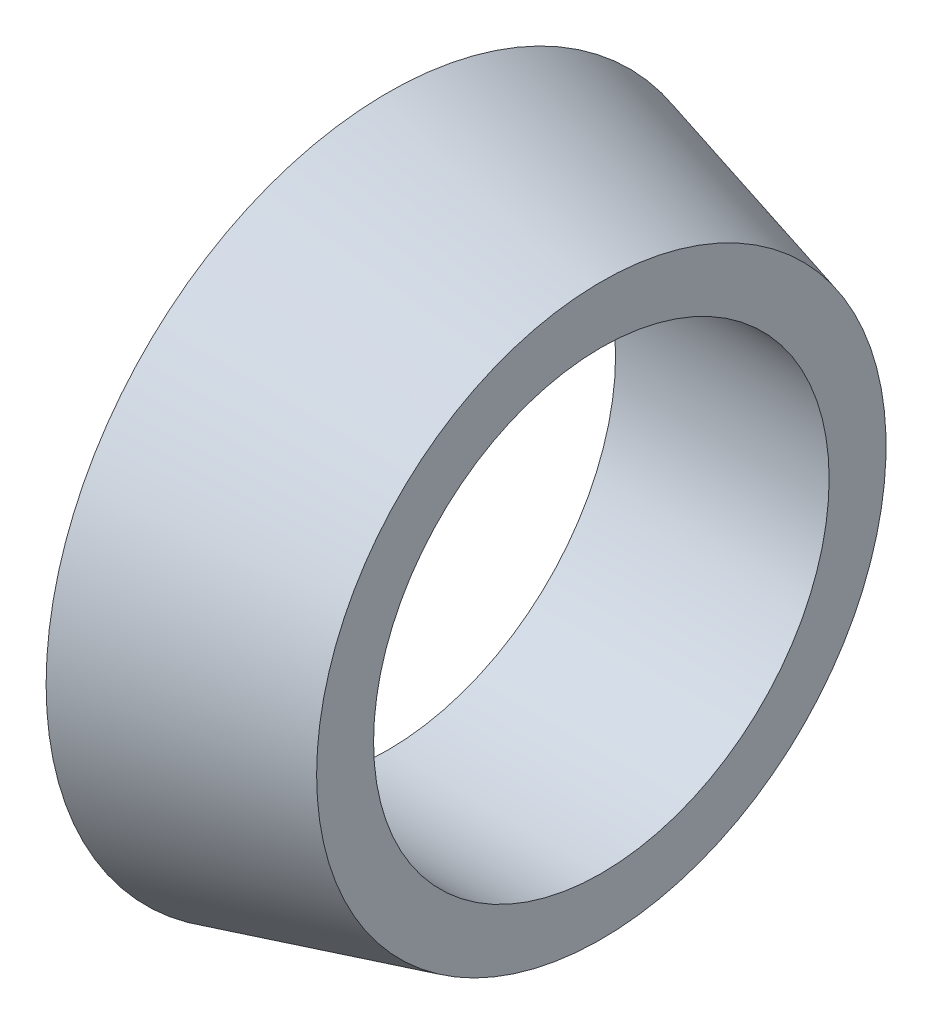
ISO-10303-21;
HEADER;
FILE_DESCRIPTION(('STEP AP214'),'2;1');
FILE_NAME('part.step','',(''),(''),'','','');
FILE_SCHEMA(('AUTOMOTIVE_DESIGN { 1 0 10303 214 1 1 1 1 }'));
ENDSEC;
DATA;
#1=APPLICATION_CONTEXT('core data for automotive mechanical design processes');
#2=APPLICATION_PROTOCOL_DEFINITION('international standard','automotive_design',2000,#1);
#3=PRODUCT_CONTEXT('',#1,'mechanical');
#4=PRODUCT('Part','Part','',(#3));
#5=PRODUCT_RELATED_PRODUCT_CATEGORY('part','',(#4));
#6=PRODUCT_DEFINITION_FORMATION('','',#4);
#7=PRODUCT_DEFINITION_CONTEXT('part definition',#1,'design');
#8=PRODUCT_DEFINITION('design','',#6,#7);
#9=PRODUCT_DEFINITION_SHAPE('','',#8);
#10=(LENGTH_UNIT() NAMED_UNIT(*) SI_UNIT(.MILLI.,.METRE.));
#11=(NAMED_UNIT(*) PLANE_ANGLE_UNIT() SI_UNIT($,.RADIAN.));
#12=(NAMED_UNIT(*) SI_UNIT($,.STERADIAN.) SOLID_ANGLE_UNIT());
#13=UNCERTAINTY_MEASURE_WITH_UNIT(LENGTH_MEASURE(1.E-05),#10,'distance_accuracy_value','');
#14=(GEOMETRIC_REPRESENTATION_CONTEXT(3) GLOBAL_UNCERTAINTY_ASSIGNED_CONTEXT((#13)) GLOBAL_UNIT_ASSIGNED_CONTEXT((#10,
#11,#12)) REPRESENTATION_CONTEXT('',''));
#15=CARTESIAN_POINT('',(0.,0.,0.));
#16=DIRECTION('',(0.,0.,1.));
#17=DIRECTION('',(1.,0.,0.));
#18=AXIS2_PLACEMENT_3D('',#15,#16,#17);
#19=CARTESIAN_POINT('',(0.,0.,0.));
#20=DIRECTION('',(-1.,0.,0.));
#21=DIRECTION('',(0.,0.,1.));
#22=AXIS2_PLACEMENT_3D('',#19,#20,#21);
#23=CYLINDRICAL_SURFACE('',#22,4.);
#24=CARTESIAN_POINT('',(3.75,0.,0.));
#25=DIRECTION('',(-1.,0.,0.));
#26=DIRECTION('',(0.,0.,1.));
#27=AXIS2_PLACEMENT_3D('',#24,#25,#26);
#28=CIRCLE('',#27,4.);
#29=CARTESIAN_POINT('',(3.75,0.,4.));
#30=VERTEX_POINT('',#29);
#31=EDGE_CURVE('E46',#30,#30,#28,.T.);
#32=ORIENTED_EDGE('',*,*,#31,.F.);
#33=EDGE_LOOP('',(#32));
#34=FACE_BOUND('',#33,.T.);
#35=CARTESIAN_POINT('',(0.,0.,0.));
#36=DIRECTION('',(-1.,0.,0.));
#37=DIRECTION('',(0.,0.,1.));
#38=AXIS2_PLACEMENT_3D('',#35,#36,#37);
#39=CIRCLE('',#38,4.);
#40=CARTESIAN_POINT('',(0.,0.,4.));
#41=VERTEX_POINT('',#40);
#42=EDGE_CURVE('E10',#41,#41,#39,.T.);
#43=ORIENTED_EDGE('',*,*,#42,.T.);
#44=EDGE_LOOP('',(#43));
#45=FACE_BOUND('',#44,.T.);
#46=ADVANCED_FACE('F32',(#34,#45),#23,.F.);
#47=CARTESIAN_POINT('',(0.,4.,0.));
#48=DIRECTION('',(1.,0.,0.));
#49=DIRECTION('',(0.,0.,-1.));
#50=AXIS2_PLACEMENT_3D('',#47,#48,#49);
#51=PLANE('',#50);
#52=ORIENTED_EDGE('',*,*,#42,.F.);
#53=EDGE_LOOP('',(#52));
#54=FACE_BOUND('',#53,.T.);
#55=CARTESIAN_POINT('',(0.,0.,0.));
#56=DIRECTION('',(-1.,0.,0.));
#57=DIRECTION('',(0.,0.,1.));
#58=AXIS2_PLACEMENT_3D('',#55,#56,#57);
#59=CIRCLE('',#58,6.);
#60=CARTESIAN_POINT('',(0.,0.,6.));
#61=VERTEX_POINT('',#60);
#62=EDGE_CURVE('E38',#61,#61,#59,.T.);
#63=ORIENTED_EDGE('',*,*,#62,.T.);
#64=EDGE_LOOP('',(#63));
#65=FACE_BOUND('',#64,.T.);
#66=ADVANCED_FACE('F55',(#54,#65),#51,.F.);
#67=CARTESIAN_POINT('',(3.75,0.,0.));
#68=DIRECTION('',(-1.,0.,0.));
#69=DIRECTION('',(0.,0.,1.));
#70=AXIS2_PLACEMENT_3D('',#67,#68,#69);
#71=CONICAL_SURFACE('',#70,5.,0.260602391747341);
#72=ORIENTED_EDGE('',*,*,#62,.F.);
#73=EDGE_LOOP('',(#72));
#74=FACE_BOUND('',#73,.T.);
#75=CARTESIAN_POINT('',(3.75,0.,0.));
#76=DIRECTION('',(-1.,0.,0.));
#77=DIRECTION('',(0.,0.,1.));
#78=AXIS2_PLACEMENT_3D('',#75,#76,#77);
#79=CIRCLE('',#78,5.);
#80=CARTESIAN_POINT('',(3.75,0.,5.));
#81=VERTEX_POINT('',#80);
#82=EDGE_CURVE('E42',#81,#81,#79,.T.);
#83=ORIENTED_EDGE('',*,*,#82,.T.);
#84=EDGE_LOOP('',(#83));
#85=FACE_BOUND('',#84,.T.);
#86=ADVANCED_FACE('F59',(#74,#85),#71,.T.);
#87=CARTESIAN_POINT('',(3.75,5.,0.));
#88=DIRECTION('',(-1.,0.,0.));
#89=DIRECTION('',(0.,0.,1.));
#90=AXIS2_PLACEMENT_3D('',#87,#88,#89);
#91=PLANE('',#90);
#92=ORIENTED_EDGE('',*,*,#82,.F.);
#93=EDGE_LOOP('',(#92));
#94=FACE_BOUND('',#93,.T.);
#95=ORIENTED_EDGE('',*,*,#31,.T.);
#96=EDGE_LOOP('',(#95));
#97=FACE_BOUND('',#96,.T.);
#98=ADVANCED_FACE('F52',(#94,#97),#91,.F.);
#99=CLOSED_SHELL('',(#46,#66,#86,#98));
#100=MANIFOLD_SOLID_BREP('B2',#99);
#101=ADVANCED_BREP_SHAPE_REPRESENTATION('',(#18,#100),#14);
#102=SHAPE_DEFINITION_REPRESENTATION(#9,#101);
ENDSEC;
END-ISO-10303-21;
